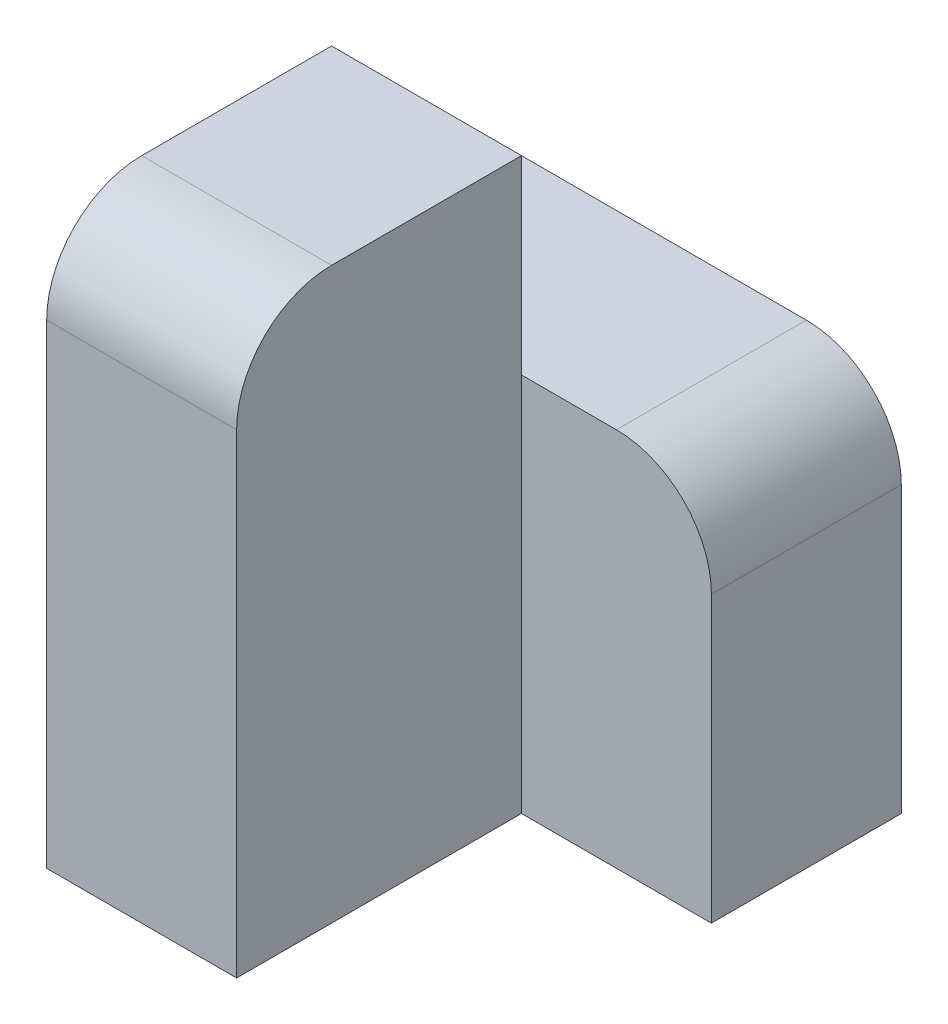
ISO-10303-21;
HEADER;
FILE_DESCRIPTION(('STEP AP214'),'2;1');
FILE_NAME('part.step','',(''),(''),'','','');
FILE_SCHEMA(('AUTOMOTIVE_DESIGN { 1 0 10303 214 1 1 1 1 }'));
ENDSEC;
DATA;
#1=APPLICATION_CONTEXT('core data for automotive mechanical design processes');
#2=APPLICATION_PROTOCOL_DEFINITION('international standard','automotive_design',2000,#1);
#3=PRODUCT_CONTEXT('',#1,'mechanical');
#4=PRODUCT('Part','Part','',(#3));
#5=PRODUCT_RELATED_PRODUCT_CATEGORY('part','',(#4));
#6=PRODUCT_DEFINITION_FORMATION('','',#4);
#7=PRODUCT_DEFINITION_CONTEXT('part definition',#1,'design');
#8=PRODUCT_DEFINITION('design','',#6,#7);
#9=PRODUCT_DEFINITION_SHAPE('','',#8);
#10=(LENGTH_UNIT() NAMED_UNIT(*) SI_UNIT(.MILLI.,.METRE.));
#11=(NAMED_UNIT(*) PLANE_ANGLE_UNIT() SI_UNIT($,.RADIAN.));
#12=(NAMED_UNIT(*) SI_UNIT($,.STERADIAN.) SOLID_ANGLE_UNIT());
#13=UNCERTAINTY_MEASURE_WITH_UNIT(LENGTH_MEASURE(1.E-05),#10,'distance_accuracy_value','');
#14=(GEOMETRIC_REPRESENTATION_CONTEXT(3) GLOBAL_UNCERTAINTY_ASSIGNED_CONTEXT((#13)) GLOBAL_UNIT_ASSIGNED_CONTEXT((#10,
#11,#12)) REPRESENTATION_CONTEXT('',''));
#15=CARTESIAN_POINT('',(0.,0.,0.));
#16=DIRECTION('',(0.,0.,1.));
#17=DIRECTION('',(1.,0.,0.));
#18=AXIS2_PLACEMENT_3D('',#15,#16,#17);
#19=CARTESIAN_POINT('',(-10.,0.,30.));
#20=DIRECTION('',(0.,-1.,0.));
#21=DIRECTION('',(1.,0.,0.));
#22=AXIS2_PLACEMENT_3D('',#19,#20,#21);
#23=PLANE('',#22);
#24=DIRECTION('',(0.,0.,-1.));
#25=VECTOR('',#24,1.);
#26=CARTESIAN_POINT('',(-30.,0.,30.));
#27=LINE('',#26,#25);
#28=CARTESIAN_POINT('',(-30.,0.,20.));
#29=VERTEX_POINT('',#28);
#30=CARTESIAN_POINT('',(-30.,0.,0.));
#31=VERTEX_POINT('',#30);
#32=EDGE_CURVE('E171',#29,#31,#27,.T.);
#33=ORIENTED_EDGE('',*,*,#32,.F.);
#34=DIRECTION('',(-1.,0.,0.));
#35=VECTOR('',#34,1.);
#36=CARTESIAN_POINT('',(-10.,0.,20.));
#37=LINE('',#36,#35);
#38=CARTESIAN_POINT('',(-10.,0.,20.));
#39=VERTEX_POINT('',#38);
#40=EDGE_CURVE('E43',#29,#39,#37,.F.);
#41=ORIENTED_EDGE('',*,*,#40,.T.);
#42=DIRECTION('',(0.,0.,-1.));
#43=VECTOR('',#42,1.);
#44=CARTESIAN_POINT('',(-10.,0.,30.));
#45=LINE('',#44,#43);
#46=CARTESIAN_POINT('',(-10.,0.,0.));
#47=VERTEX_POINT('',#46);
#48=EDGE_CURVE('E158',#39,#47,#45,.T.);
#49=ORIENTED_EDGE('',*,*,#48,.T.);
#50=DIRECTION('',(-1.,0.,0.));
#51=VECTOR('',#50,1.);
#52=CARTESIAN_POINT('',(-10.,0.,0.));
#53=LINE('',#52,#51);
#54=EDGE_CURVE('E148',#47,#31,#53,.T.);
#55=ORIENTED_EDGE('',*,*,#54,.T.);
#56=EDGE_LOOP('',(#33,#41,#49,#55));
#57=FACE_BOUND('',#56,.T.);
#58=ADVANCED_FACE('F35',(#57),#23,.F.);
#59=CARTESIAN_POINT('',(-30.,0.,30.));
#60=DIRECTION('',(1.,0.,0.));
#61=DIRECTION('',(0.,0.,-1.));
#62=AXIS2_PLACEMENT_3D('',#59,#60,#61);
#63=PLANE('',#62);
#64=DIRECTION('',(0.,-1.,0.));
#65=VECTOR('',#64,1.);
#66=CARTESIAN_POINT('',(-30.,0.,30.));
#67=LINE('',#66,#65);
#68=CARTESIAN_POINT('',(-30.,-10.,30.));
#69=VERTEX_POINT('',#68);
#70=CARTESIAN_POINT('',(-30.,-60.,30.));
#71=VERTEX_POINT('',#70);
#72=EDGE_CURVE('E150',#69,#71,#67,.T.);
#73=ORIENTED_EDGE('',*,*,#72,.F.);
#74=CARTESIAN_POINT('',(-30.,-10.,20.));
#75=DIRECTION('',(1.,0.,0.));
#76=DIRECTION('',(0.,0.,-1.));
#77=AXIS2_PLACEMENT_3D('',#74,#75,#76);
#78=CIRCLE('',#77,10.);
#79=EDGE_CURVE('E57',#69,#29,#78,.F.);
#80=ORIENTED_EDGE('',*,*,#79,.T.);
#81=ORIENTED_EDGE('',*,*,#32,.T.);
#82=DIRECTION('',(0.,-1.,0.));
#83=VECTOR('',#82,1.);
#84=CARTESIAN_POINT('',(-30.,0.,0.));
#85=LINE('',#84,#83);
#86=CARTESIAN_POINT('',(-30.,-20.,0.));
#87=VERTEX_POINT('',#86);
#88=EDGE_CURVE('E126',#31,#87,#85,.T.);
#89=ORIENTED_EDGE('',*,*,#88,.T.);
#90=DIRECTION('',(0.,0.,1.));
#91=VECTOR('',#90,1.);
#92=CARTESIAN_POINT('',(-30.,-20.,-20.));
#93=LINE('',#92,#91);
#94=CARTESIAN_POINT('',(-30.,-20.,-20.));
#95=VERTEX_POINT('',#94);
#96=EDGE_CURVE('E111',#95,#87,#93,.T.);
#97=ORIENTED_EDGE('',*,*,#96,.F.);
#98=DIRECTION('',(0.,-1.,0.));
#99=VECTOR('',#98,1.);
#100=CARTESIAN_POINT('',(-30.,-20.,-20.));
#101=LINE('',#100,#99);
#102=CARTESIAN_POINT('',(-30.,-60.,-20.));
#103=VERTEX_POINT('',#102);
#104=EDGE_CURVE('E118',#95,#103,#101,.T.);
#105=ORIENTED_EDGE('',*,*,#104,.T.);
#106=DIRECTION('',(0.,0.,-1.));
#107=VECTOR('',#106,1.);
#108=CARTESIAN_POINT('',(-30.,-60.,30.));
#109=LINE('',#108,#107);
#110=EDGE_CURVE('E169',#71,#103,#109,.T.);
#111=ORIENTED_EDGE('',*,*,#110,.F.);
#112=EDGE_LOOP('',(#73,#80,#81,#89,#97,#105,#111));
#113=FACE_BOUND('',#112,.T.);
#114=ADVANCED_FACE('F123',(#113),#63,.F.);
#115=CARTESIAN_POINT('',(-30.,-60.,30.));
#116=DIRECTION('',(0.,1.,0.));
#117=DIRECTION('',(0.,0.,1.));
#118=AXIS2_PLACEMENT_3D('',#115,#116,#117);
#119=PLANE('',#118);
#120=ORIENTED_EDGE('',*,*,#110,.T.);
#121=DIRECTION('',(1.,0.,0.));
#122=VECTOR('',#121,1.);
#123=CARTESIAN_POINT('',(-30.,-60.,-20.));
#124=LINE('',#123,#122);
#125=CARTESIAN_POINT('',(10.,-60.,-20.));
#126=VERTEX_POINT('',#125);
#127=EDGE_CURVE('E134',#103,#126,#124,.T.);
#128=ORIENTED_EDGE('',*,*,#127,.T.);
#129=DIRECTION('',(0.,0.,1.));
#130=VECTOR('',#129,1.);
#131=CARTESIAN_POINT('',(10.,-60.,-20.));
#132=LINE('',#131,#130);
#133=CARTESIAN_POINT('',(10.,-60.,0.));
#134=VERTEX_POINT('',#133);
#135=EDGE_CURVE('E127',#126,#134,#132,.T.);
#136=ORIENTED_EDGE('',*,*,#135,.T.);
#137=DIRECTION('',(1.,0.,0.));
#138=VECTOR('',#137,1.);
#139=CARTESIAN_POINT('',(-30.,-60.,0.));
#140=LINE('',#139,#138);
#141=CARTESIAN_POINT('',(-10.,-60.,0.));
#142=VERTEX_POINT('',#141);
#143=EDGE_CURVE('E142',#142,#134,#140,.T.);
#144=ORIENTED_EDGE('',*,*,#143,.F.);
#145=DIRECTION('',(0.,0.,-1.));
#146=VECTOR('',#145,1.);
#147=CARTESIAN_POINT('',(-10.,-60.,30.));
#148=LINE('',#147,#146);
#149=CARTESIAN_POINT('',(-10.,-60.,30.));
#150=VERTEX_POINT('',#149);
#151=EDGE_CURVE('E166',#150,#142,#148,.T.);
#152=ORIENTED_EDGE('',*,*,#151,.F.);
#153=DIRECTION('',(1.,0.,0.));
#154=VECTOR('',#153,1.);
#155=CARTESIAN_POINT('',(-30.,-60.,30.));
#156=LINE('',#155,#154);
#157=EDGE_CURVE('E152',#71,#150,#156,.T.);
#158=ORIENTED_EDGE('',*,*,#157,.F.);
#159=EDGE_LOOP('',(#120,#128,#136,#144,#152,#158));
#160=FACE_BOUND('',#159,.T.);
#161=ADVANCED_FACE('F193',(#160),#119,.F.);
#162=CARTESIAN_POINT('',(-10.,-60.,30.));
#163=DIRECTION('',(-1.,0.,0.));
#164=DIRECTION('',(0.,0.,1.));
#165=AXIS2_PLACEMENT_3D('',#162,#163,#164);
#166=PLANE('',#165);
#167=ORIENTED_EDGE('',*,*,#48,.F.);
#168=CARTESIAN_POINT('',(-10.,-10.,20.));
#169=DIRECTION('',(-1.,0.,0.));
#170=DIRECTION('',(0.,0.,1.));
#171=AXIS2_PLACEMENT_3D('',#168,#169,#170);
#172=CIRCLE('',#171,10.);
#173=CARTESIAN_POINT('',(-10.,-10.,30.));
#174=VERTEX_POINT('',#173);
#175=EDGE_CURVE('E11',#39,#174,#172,.F.);
#176=ORIENTED_EDGE('',*,*,#175,.T.);
#177=DIRECTION('',(0.,1.,0.));
#178=VECTOR('',#177,1.);
#179=CARTESIAN_POINT('',(-10.,-60.,30.));
#180=LINE('',#179,#178);
#181=EDGE_CURVE('E155',#150,#174,#180,.T.);
#182=ORIENTED_EDGE('',*,*,#181,.F.);
#183=ORIENTED_EDGE('',*,*,#151,.T.);
#184=DIRECTION('',(0.,1.,0.));
#185=VECTOR('',#184,1.);
#186=CARTESIAN_POINT('',(-10.,-60.,0.));
#187=LINE('',#186,#185);
#188=CARTESIAN_POINT('',(-10.,-20.,0.));
#189=VERTEX_POINT('',#188);
#190=EDGE_CURVE('E153',#142,#189,#187,.T.);
#191=ORIENTED_EDGE('',*,*,#190,.T.);
#192=EDGE_CURVE('E162',#189,#47,#187,.T.);
#193=ORIENTED_EDGE('',*,*,#192,.T.);
#194=EDGE_LOOP('',(#167,#176,#182,#183,#191,#193));
#195=FACE_BOUND('',#194,.T.);
#196=ADVANCED_FACE('F196',(#195),#166,.F.);
#197=CARTESIAN_POINT('',(0.,0.,30.));
#198=DIRECTION('',(0.,0.,1.));
#199=DIRECTION('',(1.,0.,0.));
#200=AXIS2_PLACEMENT_3D('',#197,#198,#199);
#201=PLANE('',#200);
#202=ORIENTED_EDGE('',*,*,#181,.T.);
#203=DIRECTION('',(-1.,0.,0.));
#204=VECTOR('',#203,1.);
#205=CARTESIAN_POINT('',(-30.,-10.,30.));
#206=LINE('',#205,#204);
#207=EDGE_CURVE('E181',#174,#69,#206,.T.);
#208=ORIENTED_EDGE('',*,*,#207,.T.);
#209=ORIENTED_EDGE('',*,*,#72,.T.);
#210=ORIENTED_EDGE('',*,*,#157,.T.);
#211=EDGE_LOOP('',(#202,#208,#209,#210));
#212=FACE_BOUND('',#211,.T.);
#213=ADVANCED_FACE('F186',(#212),#201,.T.);
#214=CARTESIAN_POINT('',(0.,0.,0.));
#215=DIRECTION('',(0.,0.,1.));
#216=DIRECTION('',(1.,0.,0.));
#217=AXIS2_PLACEMENT_3D('',#214,#215,#216);
#218=PLANE('',#217);
#219=ORIENTED_EDGE('',*,*,#192,.F.);
#220=DIRECTION('',(-1.,0.,0.));
#221=VECTOR('',#220,1.);
#222=CARTESIAN_POINT('',(10.,-20.,0.));
#223=LINE('',#222,#221);
#224=EDGE_CURVE('E143',#189,#87,#223,.T.);
#225=ORIENTED_EDGE('',*,*,#224,.T.);
#226=ORIENTED_EDGE('',*,*,#88,.F.);
#227=ORIENTED_EDGE('',*,*,#54,.F.);
#228=EDGE_LOOP('',(#219,#225,#226,#227));
#229=FACE_BOUND('',#228,.T.);
#230=ADVANCED_FACE('F215',(#229),#218,.F.);
#231=CARTESIAN_POINT('',(0.,0.,0.));
#232=DIRECTION('',(0.,0.,1.));
#233=DIRECTION('',(1.,0.,0.));
#234=AXIS2_PLACEMENT_3D('',#231,#232,#233);
#235=PLANE('',#234);
#236=DIRECTION('',(0.,1.,0.));
#237=VECTOR('',#236,1.);
#238=CARTESIAN_POINT('',(10.,-60.,0.));
#239=LINE('',#238,#237);
#240=CARTESIAN_POINT('',(10.,-30.,0.));
#241=VERTEX_POINT('',#240);
#242=EDGE_CURVE('E119',#134,#241,#239,.T.);
#243=ORIENTED_EDGE('',*,*,#242,.T.);
#244=CARTESIAN_POINT('',(0.,-30.,0.));
#245=DIRECTION('',(0.,0.,1.));
#246=DIRECTION('',(1.,0.,0.));
#247=AXIS2_PLACEMENT_3D('',#244,#245,#246);
#248=CIRCLE('',#247,10.);
#249=CARTESIAN_POINT('',(0.,-20.,0.));
#250=VERTEX_POINT('',#249);
#251=EDGE_CURVE('E176',#241,#250,#248,.T.);
#252=ORIENTED_EDGE('',*,*,#251,.T.);
#253=EDGE_CURVE('E140',#250,#189,#223,.T.);
#254=ORIENTED_EDGE('',*,*,#253,.T.);
#255=ORIENTED_EDGE('',*,*,#190,.F.);
#256=ORIENTED_EDGE('',*,*,#143,.T.);
#257=EDGE_LOOP('',(#243,#252,#254,#255,#256));
#258=FACE_BOUND('',#257,.T.);
#259=ADVANCED_FACE('F218',(#258),#235,.T.);
#260=CARTESIAN_POINT('',(10.,-20.,-20.));
#261=DIRECTION('',(0.,1.,0.));
#262=DIRECTION('',(-1.,0.,0.));
#263=AXIS2_PLACEMENT_3D('',#260,#261,#262);
#264=PLANE('',#263);
#265=ORIENTED_EDGE('',*,*,#253,.F.);
#266=DIRECTION('',(0.,0.,1.));
#267=VECTOR('',#266,1.);
#268=CARTESIAN_POINT('',(0.,-20.,-20.));
#269=LINE('',#268,#267);
#270=CARTESIAN_POINT('',(0.,-20.,-20.));
#271=VERTEX_POINT('',#270);
#272=EDGE_CURVE('E114',#250,#271,#269,.F.);
#273=ORIENTED_EDGE('',*,*,#272,.T.);
#274=DIRECTION('',(-1.,0.,0.));
#275=VECTOR('',#274,1.);
#276=CARTESIAN_POINT('',(10.,-20.,-20.));
#277=LINE('',#276,#275);
#278=EDGE_CURVE('E106',#271,#95,#277,.T.);
#279=ORIENTED_EDGE('',*,*,#278,.T.);
#280=ORIENTED_EDGE('',*,*,#96,.T.);
#281=ORIENTED_EDGE('',*,*,#224,.F.);
#282=EDGE_LOOP('',(#265,#273,#279,#280,#281));
#283=FACE_BOUND('',#282,.T.);
#284=ADVANCED_FACE('F109',(#283),#264,.T.);
#285=CARTESIAN_POINT('',(10.,-60.,-20.));
#286=DIRECTION('',(1.,0.,0.));
#287=DIRECTION('',(0.,0.,-1.));
#288=AXIS2_PLACEMENT_3D('',#285,#286,#287);
#289=PLANE('',#288);
#290=DIRECTION('',(0.,1.,0.));
#291=VECTOR('',#290,1.);
#292=CARTESIAN_POINT('',(10.,-60.,-20.));
#293=LINE('',#292,#291);
#294=CARTESIAN_POINT('',(10.,-30.,-20.));
#295=VERTEX_POINT('',#294);
#296=EDGE_CURVE('E128',#126,#295,#293,.T.);
#297=ORIENTED_EDGE('',*,*,#296,.T.);
#298=DIRECTION('',(0.,0.,1.));
#299=VECTOR('',#298,1.);
#300=CARTESIAN_POINT('',(10.,-30.,-20.));
#301=LINE('',#300,#299);
#302=EDGE_CURVE('E173',#295,#241,#301,.T.);
#303=ORIENTED_EDGE('',*,*,#302,.T.);
#304=ORIENTED_EDGE('',*,*,#242,.F.);
#305=ORIENTED_EDGE('',*,*,#135,.F.);
#306=EDGE_LOOP('',(#297,#303,#304,#305));
#307=FACE_BOUND('',#306,.T.);
#308=ADVANCED_FACE('F224',(#307),#289,.T.);
#309=CARTESIAN_POINT('',(0.,0.,-20.));
#310=DIRECTION('',(0.,0.,1.));
#311=DIRECTION('',(1.,0.,0.));
#312=AXIS2_PLACEMENT_3D('',#309,#310,#311);
#313=PLANE('',#312);
#314=ORIENTED_EDGE('',*,*,#278,.F.);
#315=CARTESIAN_POINT('',(0.,-30.,-20.));
#316=DIRECTION('',(0.,0.,1.));
#317=DIRECTION('',(1.,0.,0.));
#318=AXIS2_PLACEMENT_3D('',#315,#316,#317);
#319=CIRCLE('',#318,10.);
#320=EDGE_CURVE('E179',#271,#295,#319,.F.);
#321=ORIENTED_EDGE('',*,*,#320,.T.);
#322=ORIENTED_EDGE('',*,*,#296,.F.);
#323=ORIENTED_EDGE('',*,*,#127,.F.);
#324=ORIENTED_EDGE('',*,*,#104,.F.);
#325=EDGE_LOOP('',(#314,#321,#322,#323,#324));
#326=FACE_BOUND('',#325,.T.);
#327=ADVANCED_FACE('F131',(#326),#313,.F.);
#328=CARTESIAN_POINT('',(0.,-30.,-20.));
#329=DIRECTION('',(0.,0.,1.));
#330=DIRECTION('',(1.,0.,0.));
#331=AXIS2_PLACEMENT_3D('',#328,#329,#330);
#332=CYLINDRICAL_SURFACE('',#331,10.);
#333=ORIENTED_EDGE('',*,*,#320,.F.);
#334=ORIENTED_EDGE('',*,*,#272,.F.);
#335=ORIENTED_EDGE('',*,*,#251,.F.);
#336=ORIENTED_EDGE('',*,*,#302,.F.);
#337=EDGE_LOOP('',(#333,#334,#335,#336));
#338=FACE_BOUND('',#337,.T.);
#339=ADVANCED_FACE('F199',(#338),#332,.T.);
#340=CARTESIAN_POINT('',(0.,-10.,20.));
#341=DIRECTION('',(1.,0.,0.));
#342=DIRECTION('',(0.,1.,0.));
#343=AXIS2_PLACEMENT_3D('',#340,#341,#342);
#344=CYLINDRICAL_SURFACE('',#343,10.);
#345=ORIENTED_EDGE('',*,*,#175,.F.);
#346=ORIENTED_EDGE('',*,*,#40,.F.);
#347=ORIENTED_EDGE('',*,*,#79,.F.);
#348=ORIENTED_EDGE('',*,*,#207,.F.);
#349=EDGE_LOOP('',(#345,#346,#347,#348));
#350=FACE_BOUND('',#349,.T.);
#351=ADVANCED_FACE('F37',(#350),#344,.T.);
#352=CLOSED_SHELL('',(#58,#114,#161,#196,#213,#230,#259,#284,#308,#327,#339,#351));
#353=MANIFOLD_SOLID_BREP('B2',#352);
#354=ADVANCED_BREP_SHAPE_REPRESENTATION('',(#18,#353),#14);
#355=SHAPE_DEFINITION_REPRESENTATION(#9,#354);
ENDSEC;
END-ISO-10303-21;
